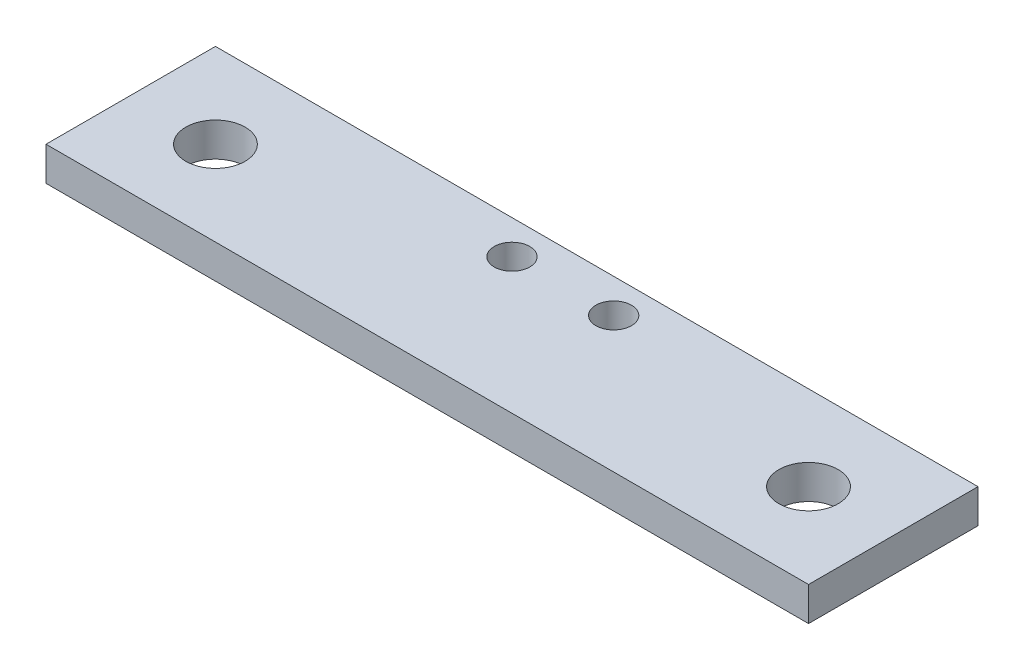
ISO-10303-21;
HEADER;
FILE_DESCRIPTION(('STEP AP214'),'2;1');
FILE_NAME('part.step','',(''),(''),'','','');
FILE_SCHEMA(('AUTOMOTIVE_DESIGN { 1 0 10303 214 1 1 1 1 }'));
ENDSEC;
DATA;
#1=APPLICATION_CONTEXT('core data for automotive mechanical design processes');
#2=APPLICATION_PROTOCOL_DEFINITION('international standard','automotive_design',2000,#1);
#3=PRODUCT_CONTEXT('',#1,'mechanical');
#4=PRODUCT('Part','Part','',(#3));
#5=PRODUCT_RELATED_PRODUCT_CATEGORY('part','',(#4));
#6=PRODUCT_DEFINITION_FORMATION('','',#4);
#7=PRODUCT_DEFINITION_CONTEXT('part definition',#1,'design');
#8=PRODUCT_DEFINITION('design','',#6,#7);
#9=PRODUCT_DEFINITION_SHAPE('','',#8);
#10=(LENGTH_UNIT() NAMED_UNIT(*) SI_UNIT(.MILLI.,.METRE.));
#11=(NAMED_UNIT(*) PLANE_ANGLE_UNIT() SI_UNIT($,.RADIAN.));
#12=(NAMED_UNIT(*) SI_UNIT($,.STERADIAN.) SOLID_ANGLE_UNIT());
#13=UNCERTAINTY_MEASURE_WITH_UNIT(LENGTH_MEASURE(1.E-05),#10,'distance_accuracy_value','');
#14=(GEOMETRIC_REPRESENTATION_CONTEXT(3) GLOBAL_UNCERTAINTY_ASSIGNED_CONTEXT((#13)) GLOBAL_UNIT_ASSIGNED_CONTEXT((#10,
#11,#12)) REPRESENTATION_CONTEXT('',''));
#15=CARTESIAN_POINT('',(0.,0.,0.));
#16=DIRECTION('',(0.,0.,1.));
#17=DIRECTION('',(1.,0.,0.));
#18=AXIS2_PLACEMENT_3D('',#15,#16,#17);
#19=CARTESIAN_POINT('',(45.,4.,10.));
#20=DIRECTION('',(-1.,0.,0.));
#21=DIRECTION('',(0.,0.,1.));
#22=AXIS2_PLACEMENT_3D('',#19,#20,#21);
#23=PLANE('',#22);
#24=DIRECTION('',(0.,0.,-1.));
#25=VECTOR('',#24,1.);
#26=CARTESIAN_POINT('',(45.,0.,10.));
#27=LINE('',#26,#25);
#28=CARTESIAN_POINT('',(45.,0.,10.));
#29=VERTEX_POINT('',#28);
#30=CARTESIAN_POINT('',(45.,0.,-10.));
#31=VERTEX_POINT('',#30);
#32=EDGE_CURVE('E101',#29,#31,#27,.T.);
#33=ORIENTED_EDGE('',*,*,#32,.T.);
#34=DIRECTION('',(0.,-1.,0.));
#35=VECTOR('',#34,1.);
#36=CARTESIAN_POINT('',(45.,4.,-10.));
#37=LINE('',#36,#35);
#38=CARTESIAN_POINT('',(45.,4.,-10.));
#39=VERTEX_POINT('',#38);
#40=EDGE_CURVE('E11',#39,#31,#37,.T.);
#41=ORIENTED_EDGE('',*,*,#40,.F.);
#42=DIRECTION('',(0.,0.,-1.));
#43=VECTOR('',#42,1.);
#44=CARTESIAN_POINT('',(45.,4.,10.));
#45=LINE('',#44,#43);
#46=CARTESIAN_POINT('',(45.,4.,10.));
#47=VERTEX_POINT('',#46);
#48=EDGE_CURVE('E86',#47,#39,#45,.T.);
#49=ORIENTED_EDGE('',*,*,#48,.F.);
#50=DIRECTION('',(0.,-1.,0.));
#51=VECTOR('',#50,1.);
#52=CARTESIAN_POINT('',(45.,4.,10.));
#53=LINE('',#52,#51);
#54=EDGE_CURVE('E53',#47,#29,#53,.T.);
#55=ORIENTED_EDGE('',*,*,#54,.T.);
#56=EDGE_LOOP('',(#33,#41,#49,#55));
#57=FACE_BOUND('',#56,.T.);
#58=ADVANCED_FACE('F35',(#57),#23,.F.);
#59=CARTESIAN_POINT('',(45.,4.,-10.));
#60=DIRECTION('',(0.,0.,1.));
#61=DIRECTION('',(1.,0.,0.));
#62=AXIS2_PLACEMENT_3D('',#59,#60,#61);
#63=PLANE('',#62);
#64=DIRECTION('',(-1.,0.,0.));
#65=VECTOR('',#64,1.);
#66=CARTESIAN_POINT('',(45.,0.,-10.));
#67=LINE('',#66,#65);
#68=CARTESIAN_POINT('',(-45.,0.,-9.99999999999999));
#69=VERTEX_POINT('',#68);
#70=EDGE_CURVE('E91',#31,#69,#67,.T.);
#71=ORIENTED_EDGE('',*,*,#70,.T.);
#72=DIRECTION('',(0.,-1.,0.));
#73=VECTOR('',#72,1.);
#74=CARTESIAN_POINT('',(-45.,4.,-9.99999999999999));
#75=LINE('',#74,#73);
#76=CARTESIAN_POINT('',(-45.,4.,-9.99999999999999));
#77=VERTEX_POINT('',#76);
#78=EDGE_CURVE('E44',#77,#69,#75,.T.);
#79=ORIENTED_EDGE('',*,*,#78,.F.);
#80=DIRECTION('',(-1.,0.,0.));
#81=VECTOR('',#80,1.);
#82=CARTESIAN_POINT('',(45.,4.,-10.));
#83=LINE('',#82,#81);
#84=EDGE_CURVE('E78',#39,#77,#83,.T.);
#85=ORIENTED_EDGE('',*,*,#84,.F.);
#86=ORIENTED_EDGE('',*,*,#40,.T.);
#87=EDGE_LOOP('',(#71,#79,#85,#86));
#88=FACE_BOUND('',#87,.T.);
#89=ADVANCED_FACE('F90',(#88),#63,.F.);
#90=CARTESIAN_POINT('',(-45.,4.,10.));
#91=DIRECTION('',(-1.,0.,0.));
#92=DIRECTION('',(0.,0.,1.));
#93=AXIS2_PLACEMENT_3D('',#90,#91,#92);
#94=PLANE('',#93);
#95=DIRECTION('',(0.,0.,-1.));
#96=VECTOR('',#95,1.);
#97=CARTESIAN_POINT('',(-45.,0.,10.));
#98=LINE('',#97,#96);
#99=CARTESIAN_POINT('',(-45.,0.,10.));
#100=VERTEX_POINT('',#99);
#101=EDGE_CURVE('E104',#100,#69,#98,.T.);
#102=ORIENTED_EDGE('',*,*,#101,.F.);
#103=DIRECTION('',(0.,-1.,0.));
#104=VECTOR('',#103,1.);
#105=CARTESIAN_POINT('',(-45.,4.,10.));
#106=LINE('',#105,#104);
#107=CARTESIAN_POINT('',(-45.,4.,10.));
#108=VERTEX_POINT('',#107);
#109=EDGE_CURVE('E67',#108,#100,#106,.T.);
#110=ORIENTED_EDGE('',*,*,#109,.F.);
#111=DIRECTION('',(0.,0.,-1.));
#112=VECTOR('',#111,1.);
#113=CARTESIAN_POINT('',(-45.,4.,10.));
#114=LINE('',#113,#112);
#115=EDGE_CURVE('E85',#108,#77,#114,.T.);
#116=ORIENTED_EDGE('',*,*,#115,.T.);
#117=ORIENTED_EDGE('',*,*,#78,.T.);
#118=EDGE_LOOP('',(#102,#110,#116,#117));
#119=FACE_BOUND('',#118,.T.);
#120=ADVANCED_FACE('F95',(#119),#94,.T.);
#121=CARTESIAN_POINT('',(45.,4.,10.));
#122=DIRECTION('',(0.,0.,1.));
#123=DIRECTION('',(1.,0.,0.));
#124=AXIS2_PLACEMENT_3D('',#121,#122,#123);
#125=PLANE('',#124);
#126=DIRECTION('',(-1.,0.,0.));
#127=VECTOR('',#126,1.);
#128=CARTESIAN_POINT('',(45.,0.,10.));
#129=LINE('',#128,#127);
#130=EDGE_CURVE('E106',#29,#100,#129,.T.);
#131=ORIENTED_EDGE('',*,*,#130,.F.);
#132=ORIENTED_EDGE('',*,*,#54,.F.);
#133=DIRECTION('',(-1.,0.,0.));
#134=VECTOR('',#133,1.);
#135=CARTESIAN_POINT('',(45.,4.,10.));
#136=LINE('',#135,#134);
#137=EDGE_CURVE('E96',#47,#108,#136,.T.);
#138=ORIENTED_EDGE('',*,*,#137,.T.);
#139=ORIENTED_EDGE('',*,*,#109,.T.);
#140=EDGE_LOOP('',(#131,#132,#138,#139));
#141=FACE_BOUND('',#140,.T.);
#142=ADVANCED_FACE('F143',(#141),#125,.T.);
#143=CARTESIAN_POINT('',(0.,4.,0.));
#144=DIRECTION('',(0.,1.,0.));
#145=DIRECTION('',(0.,0.,1.));
#146=AXIS2_PLACEMENT_3D('',#143,#144,#145);
#147=PLANE('',#146);
#148=CARTESIAN_POINT('',(-35.,4.,0.));
#149=DIRECTION('',(0.,1.,0.));
#150=DIRECTION('',(0.,0.,1.));
#151=AXIS2_PLACEMENT_3D('',#148,#149,#150);
#152=CIRCLE('',#151,3.5);
#153=CARTESIAN_POINT('',(-35.,4.,3.5));
#154=VERTEX_POINT('',#153);
#155=EDGE_CURVE('E115',#154,#154,#152,.T.);
#156=ORIENTED_EDGE('',*,*,#155,.F.);
#157=EDGE_LOOP('',(#156));
#158=FACE_BOUND('',#157,.T.);
#159=CARTESIAN_POINT('',(6.,4.,-6.00000000000001));
#160=DIRECTION('',(0.,1.,0.));
#161=DIRECTION('',(0.,0.,1.));
#162=AXIS2_PLACEMENT_3D('',#159,#160,#161);
#163=CIRCLE('',#162,2.1);
#164=CARTESIAN_POINT('',(6.,4.,-3.90000000000001));
#165=VERTEX_POINT('',#164);
#166=EDGE_CURVE('E175',#165,#165,#163,.T.);
#167=ORIENTED_EDGE('',*,*,#166,.F.);
#168=EDGE_LOOP('',(#167));
#169=FACE_BOUND('',#168,.T.);
#170=CARTESIAN_POINT('',(-6.,4.,-6.00000000000001));
#171=DIRECTION('',(0.,1.,0.));
#172=DIRECTION('',(0.,0.,1.));
#173=AXIS2_PLACEMENT_3D('',#170,#171,#172);
#174=CIRCLE('',#173,2.1);
#175=CARTESIAN_POINT('',(-6.,4.,-3.90000000000001));
#176=VERTEX_POINT('',#175);
#177=EDGE_CURVE('E171',#176,#176,#174,.T.);
#178=ORIENTED_EDGE('',*,*,#177,.F.);
#179=EDGE_LOOP('',(#178));
#180=FACE_BOUND('',#179,.T.);
#181=CARTESIAN_POINT('',(35.,4.,0.));
#182=DIRECTION('',(0.,1.,0.));
#183=DIRECTION('',(0.,0.,1.));
#184=AXIS2_PLACEMENT_3D('',#181,#182,#183);
#185=CIRCLE('',#184,3.5);
#186=CARTESIAN_POINT('',(35.,4.,3.5));
#187=VERTEX_POINT('',#186);
#188=EDGE_CURVE('E167',#187,#187,#185,.T.);
#189=ORIENTED_EDGE('',*,*,#188,.F.);
#190=EDGE_LOOP('',(#189));
#191=FACE_BOUND('',#190,.T.);
#192=ORIENTED_EDGE('',*,*,#48,.T.);
#193=ORIENTED_EDGE('',*,*,#84,.T.);
#194=ORIENTED_EDGE('',*,*,#115,.F.);
#195=ORIENTED_EDGE('',*,*,#137,.F.);
#196=EDGE_LOOP('',(#192,#193,#194,#195));
#197=FACE_BOUND('',#196,.T.);
#198=ADVANCED_FACE('F82',(#158,#169,#180,#191,#197),#147,.T.);
#199=CARTESIAN_POINT('',(0.,0.,0.));
#200=DIRECTION('',(0.,1.,0.));
#201=DIRECTION('',(0.,0.,1.));
#202=AXIS2_PLACEMENT_3D('',#199,#200,#201);
#203=PLANE('',#202);
#204=CARTESIAN_POINT('',(-35.,0.,0.));
#205=DIRECTION('',(0.,1.,0.));
#206=DIRECTION('',(0.,0.,1.));
#207=AXIS2_PLACEMENT_3D('',#204,#205,#206);
#208=CIRCLE('',#207,3.5);
#209=CARTESIAN_POINT('',(-35.,0.,3.5));
#210=VERTEX_POINT('',#209);
#211=EDGE_CURVE('E38',#210,#210,#208,.T.);
#212=ORIENTED_EDGE('',*,*,#211,.T.);
#213=EDGE_LOOP('',(#212));
#214=FACE_BOUND('',#213,.T.);
#215=CARTESIAN_POINT('',(6.,0.,-6.00000000000001));
#216=DIRECTION('',(0.,1.,0.));
#217=DIRECTION('',(0.,0.,1.));
#218=AXIS2_PLACEMENT_3D('',#215,#216,#217);
#219=CIRCLE('',#218,2.1);
#220=CARTESIAN_POINT('',(6.,0.,-3.90000000000001));
#221=VERTEX_POINT('',#220);
#222=EDGE_CURVE('E117',#221,#221,#219,.T.);
#223=ORIENTED_EDGE('',*,*,#222,.T.);
#224=EDGE_LOOP('',(#223));
#225=FACE_BOUND('',#224,.T.);
#226=CARTESIAN_POINT('',(-6.,0.,-6.00000000000001));
#227=DIRECTION('',(0.,1.,0.));
#228=DIRECTION('',(0.,0.,1.));
#229=AXIS2_PLACEMENT_3D('',#226,#227,#228);
#230=CIRCLE('',#229,2.1);
#231=CARTESIAN_POINT('',(-6.,0.,-3.90000000000001));
#232=VERTEX_POINT('',#231);
#233=EDGE_CURVE('E114',#232,#232,#230,.T.);
#234=ORIENTED_EDGE('',*,*,#233,.T.);
#235=EDGE_LOOP('',(#234));
#236=FACE_BOUND('',#235,.T.);
#237=CARTESIAN_POINT('',(35.,0.,0.));
#238=DIRECTION('',(0.,1.,0.));
#239=DIRECTION('',(0.,0.,1.));
#240=AXIS2_PLACEMENT_3D('',#237,#238,#239);
#241=CIRCLE('',#240,3.5);
#242=CARTESIAN_POINT('',(35.,0.,3.5));
#243=VERTEX_POINT('',#242);
#244=EDGE_CURVE('E111',#243,#243,#241,.T.);
#245=ORIENTED_EDGE('',*,*,#244,.T.);
#246=EDGE_LOOP('',(#245));
#247=FACE_BOUND('',#246,.T.);
#248=ORIENTED_EDGE('',*,*,#32,.F.);
#249=ORIENTED_EDGE('',*,*,#130,.T.);
#250=ORIENTED_EDGE('',*,*,#101,.T.);
#251=ORIENTED_EDGE('',*,*,#70,.F.);
#252=EDGE_LOOP('',(#248,#249,#250,#251));
#253=FACE_BOUND('',#252,.T.);
#254=ADVANCED_FACE('F124',(#214,#225,#236,#247,#253),#203,.F.);
#255=CARTESIAN_POINT('',(35.,-6.,0.));
#256=DIRECTION('',(0.,1.,0.));
#257=DIRECTION('',(0.,0.,1.));
#258=AXIS2_PLACEMENT_3D('',#255,#256,#257);
#259=CYLINDRICAL_SURFACE('',#258,3.5);
#260=ORIENTED_EDGE('',*,*,#188,.T.);
#261=EDGE_LOOP('',(#260));
#262=FACE_BOUND('',#261,.T.);
#263=ORIENTED_EDGE('',*,*,#244,.F.);
#264=EDGE_LOOP('',(#263));
#265=FACE_BOUND('',#264,.T.);
#266=ADVANCED_FACE('F155',(#262,#265),#259,.F.);
#267=CARTESIAN_POINT('',(-6.,-6.,-6.00000000000001));
#268=DIRECTION('',(0.,1.,0.));
#269=DIRECTION('',(0.,0.,1.));
#270=AXIS2_PLACEMENT_3D('',#267,#268,#269);
#271=CYLINDRICAL_SURFACE('',#270,2.1);
#272=ORIENTED_EDGE('',*,*,#177,.T.);
#273=EDGE_LOOP('',(#272));
#274=FACE_BOUND('',#273,.T.);
#275=ORIENTED_EDGE('',*,*,#233,.F.);
#276=EDGE_LOOP('',(#275));
#277=FACE_BOUND('',#276,.T.);
#278=ADVANCED_FACE('F134',(#274,#277),#271,.F.);
#279=CARTESIAN_POINT('',(6.,-6.,-6.00000000000001));
#280=DIRECTION('',(0.,1.,0.));
#281=DIRECTION('',(0.,0.,1.));
#282=AXIS2_PLACEMENT_3D('',#279,#280,#281);
#283=CYLINDRICAL_SURFACE('',#282,2.1);
#284=ORIENTED_EDGE('',*,*,#166,.T.);
#285=EDGE_LOOP('',(#284));
#286=FACE_BOUND('',#285,.T.);
#287=ORIENTED_EDGE('',*,*,#222,.F.);
#288=EDGE_LOOP('',(#287));
#289=FACE_BOUND('',#288,.T.);
#290=ADVANCED_FACE('F128',(#286,#289),#283,.F.);
#291=CARTESIAN_POINT('',(-35.,-6.,0.));
#292=DIRECTION('',(0.,1.,0.));
#293=DIRECTION('',(0.,0.,1.));
#294=AXIS2_PLACEMENT_3D('',#291,#292,#293);
#295=CYLINDRICAL_SURFACE('',#294,3.5);
#296=ORIENTED_EDGE('',*,*,#155,.T.);
#297=EDGE_LOOP('',(#296));
#298=FACE_BOUND('',#297,.T.);
#299=ORIENTED_EDGE('',*,*,#211,.F.);
#300=EDGE_LOOP('',(#299));
#301=FACE_BOUND('',#300,.T.);
#302=ADVANCED_FACE('F126',(#298,#301),#295,.F.);
#303=CLOSED_SHELL('',(#58,#89,#120,#142,#198,#254,#266,#278,#290,#302));
#304=MANIFOLD_SOLID_BREP('B2',#303);
#305=ADVANCED_BREP_SHAPE_REPRESENTATION('',(#18,#304),#14);
#306=SHAPE_DEFINITION_REPRESENTATION(#9,#305);
ENDSEC;
END-ISO-10303-21;
